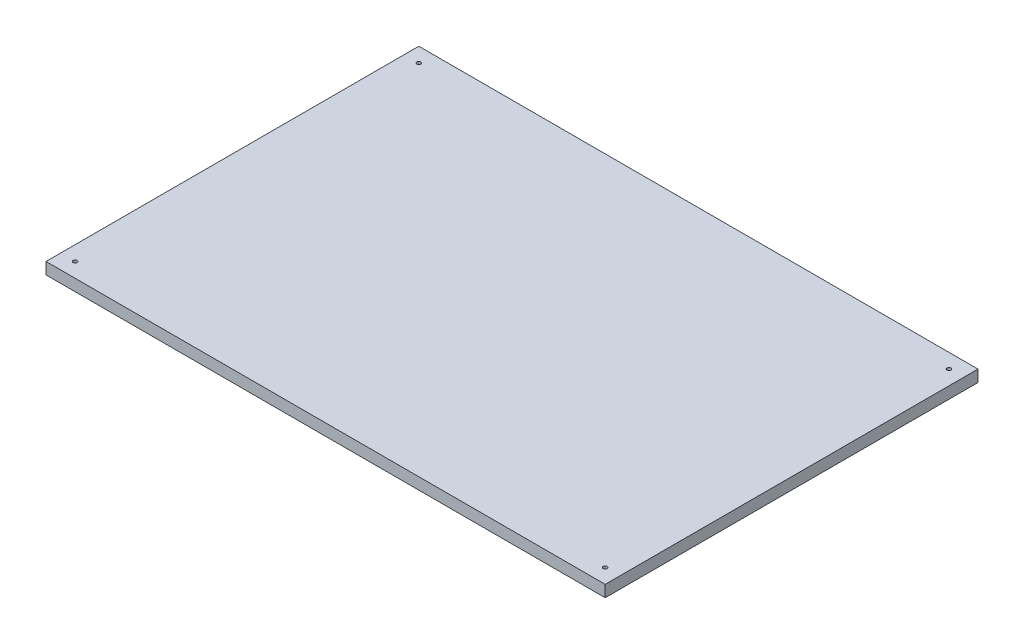
ISO-10303-21;
HEADER;
FILE_DESCRIPTION(('STEP AP214'),'2;1');
FILE_NAME('part.step','',(''),(''),'','','');
FILE_SCHEMA(('AUTOMOTIVE_DESIGN { 1 0 10303 214 1 1 1 1 }'));
ENDSEC;
DATA;
#1=APPLICATION_CONTEXT('core data for automotive mechanical design processes');
#2=APPLICATION_PROTOCOL_DEFINITION('international standard','automotive_design',2000,#1);
#3=PRODUCT_CONTEXT('',#1,'mechanical');
#4=PRODUCT('Part','Part','',(#3));
#5=PRODUCT_RELATED_PRODUCT_CATEGORY('part','',(#4));
#6=PRODUCT_DEFINITION_FORMATION('','',#4);
#7=PRODUCT_DEFINITION_CONTEXT('part definition',#1,'design');
#8=PRODUCT_DEFINITION('design','',#6,#7);
#9=PRODUCT_DEFINITION_SHAPE('','',#8);
#10=(LENGTH_UNIT() NAMED_UNIT(*) SI_UNIT(.MILLI.,.METRE.));
#11=(NAMED_UNIT(*) PLANE_ANGLE_UNIT() SI_UNIT($,.RADIAN.));
#12=(NAMED_UNIT(*) SI_UNIT($,.STERADIAN.) SOLID_ANGLE_UNIT());
#13=UNCERTAINTY_MEASURE_WITH_UNIT(LENGTH_MEASURE(1.E-05),#10,'distance_accuracy_value','');
#14=(GEOMETRIC_REPRESENTATION_CONTEXT(3) GLOBAL_UNCERTAINTY_ASSIGNED_CONTEXT((#13)) GLOBAL_UNIT_ASSIGNED_CONTEXT((#10,
#11,#12)) REPRESENTATION_CONTEXT('',''));
#15=CARTESIAN_POINT('',(0.,0.,0.));
#16=DIRECTION('',(0.,0.,1.));
#17=DIRECTION('',(1.,0.,0.));
#18=AXIS2_PLACEMENT_3D('',#15,#16,#17);
#19=CARTESIAN_POINT('',(-239.515434072486,10.,-77.7938023357789));
#20=DIRECTION('',(1.,0.,0.));
#21=DIRECTION('',(0.,0.,-1.));
#22=AXIS2_PLACEMENT_3D('',#19,#20,#21);
#23=PLANE('',#22);
#24=DIRECTION('',(0.,0.,1.));
#25=VECTOR('',#24,1.);
#26=CARTESIAN_POINT('',(-239.515434072486,0.,-77.7938023357789));
#27=LINE('',#26,#25);
#28=CARTESIAN_POINT('',(-239.515434072486,0.,-77.7938023357789));
#29=VERTEX_POINT('',#28);
#30=CARTESIAN_POINT('',(-239.515434072486,0.,242.206197664221));
#31=VERTEX_POINT('',#30);
#32=EDGE_CURVE('E95',#29,#31,#27,.T.);
#33=ORIENTED_EDGE('',*,*,#32,.T.);
#34=DIRECTION('',(0.,-1.,0.));
#35=VECTOR('',#34,1.);
#36=CARTESIAN_POINT('',(-239.515434072486,10.,242.206197664221));
#37=LINE('',#36,#35);
#38=CARTESIAN_POINT('',(-239.515434072486,10.,242.206197664221));
#39=VERTEX_POINT('',#38);
#40=EDGE_CURVE('E11',#39,#31,#37,.T.);
#41=ORIENTED_EDGE('',*,*,#40,.F.);
#42=DIRECTION('',(0.,0.,1.));
#43=VECTOR('',#42,1.);
#44=CARTESIAN_POINT('',(-239.515434072486,10.,-77.7938023357789));
#45=LINE('',#44,#43);
#46=CARTESIAN_POINT('',(-239.515434072486,10.,-77.7938023357789));
#47=VERTEX_POINT('',#46);
#48=EDGE_CURVE('E83',#47,#39,#45,.T.);
#49=ORIENTED_EDGE('',*,*,#48,.F.);
#50=DIRECTION('',(0.,-1.,0.));
#51=VECTOR('',#50,1.);
#52=CARTESIAN_POINT('',(-239.515434072486,10.,-77.7938023357789));
#53=LINE('',#52,#51);
#54=EDGE_CURVE('E91',#47,#29,#53,.T.);
#55=ORIENTED_EDGE('',*,*,#54,.T.);
#56=EDGE_LOOP('',(#33,#41,#49,#55));
#57=FACE_BOUND('',#56,.T.);
#58=ADVANCED_FACE('F32',(#57),#23,.F.);
#59=CARTESIAN_POINT('',(-239.515434072486,10.,242.206197664221));
#60=DIRECTION('',(0.,0.,-1.));
#61=DIRECTION('',(-1.,0.,0.));
#62=AXIS2_PLACEMENT_3D('',#59,#60,#61);
#63=PLANE('',#62);
#64=DIRECTION('',(1.,0.,0.));
#65=VECTOR('',#64,1.);
#66=CARTESIAN_POINT('',(-239.515434072486,0.,242.206197664221));
#67=LINE('',#66,#65);
#68=CARTESIAN_POINT('',(240.484565927514,0.,242.206197664221));
#69=VERTEX_POINT('',#68);
#70=EDGE_CURVE('E87',#31,#69,#67,.T.);
#71=ORIENTED_EDGE('',*,*,#70,.T.);
#72=DIRECTION('',(0.,-1.,0.));
#73=VECTOR('',#72,1.);
#74=CARTESIAN_POINT('',(240.484565927514,10.,242.206197664221));
#75=LINE('',#74,#73);
#76=CARTESIAN_POINT('',(240.484565927514,10.,242.206197664221));
#77=VERTEX_POINT('',#76);
#78=EDGE_CURVE('E40',#77,#69,#75,.T.);
#79=ORIENTED_EDGE('',*,*,#78,.F.);
#80=DIRECTION('',(1.,0.,0.));
#81=VECTOR('',#80,1.);
#82=CARTESIAN_POINT('',(-239.515434072486,10.,242.206197664221));
#83=LINE('',#82,#81);
#84=EDGE_CURVE('E78',#39,#77,#83,.T.);
#85=ORIENTED_EDGE('',*,*,#84,.F.);
#86=ORIENTED_EDGE('',*,*,#40,.T.);
#87=EDGE_LOOP('',(#71,#79,#85,#86));
#88=FACE_BOUND('',#87,.T.);
#89=ADVANCED_FACE('F86',(#88),#63,.F.);
#90=CARTESIAN_POINT('',(240.484565927514,10.,-77.7938023357789));
#91=DIRECTION('',(-1.,0.,0.));
#92=DIRECTION('',(0.,0.,1.));
#93=AXIS2_PLACEMENT_3D('',#90,#91,#92);
#94=PLANE('',#93);
#95=DIRECTION('',(0.,0.,-1.));
#96=VECTOR('',#95,1.);
#97=CARTESIAN_POINT('',(240.484565927514,0.,-77.7938023357789));
#98=LINE('',#97,#96);
#99=CARTESIAN_POINT('',(240.484565927514,0.,-77.7938023357789));
#100=VERTEX_POINT('',#99);
#101=EDGE_CURVE('E65',#69,#100,#98,.T.);
#102=ORIENTED_EDGE('',*,*,#101,.T.);
#103=DIRECTION('',(0.,-1.,0.));
#104=VECTOR('',#103,1.);
#105=CARTESIAN_POINT('',(240.484565927514,10.,-77.7938023357789));
#106=LINE('',#105,#104);
#107=CARTESIAN_POINT('',(240.484565927514,10.,-77.7938023357789));
#108=VERTEX_POINT('',#107);
#109=EDGE_CURVE('E88',#108,#100,#106,.T.);
#110=ORIENTED_EDGE('',*,*,#109,.F.);
#111=DIRECTION('',(0.,0.,-1.));
#112=VECTOR('',#111,1.);
#113=CARTESIAN_POINT('',(240.484565927514,10.,-77.7938023357789));
#114=LINE('',#113,#112);
#115=EDGE_CURVE('E81',#77,#108,#114,.T.);
#116=ORIENTED_EDGE('',*,*,#115,.F.);
#117=ORIENTED_EDGE('',*,*,#78,.T.);
#118=EDGE_LOOP('',(#102,#110,#116,#117));
#119=FACE_BOUND('',#118,.T.);
#120=ADVANCED_FACE('F89',(#119),#94,.F.);
#121=CARTESIAN_POINT('',(-239.515434072486,10.,-77.7938023357789));
#122=DIRECTION('',(0.,0.,1.));
#123=DIRECTION('',(1.,0.,0.));
#124=AXIS2_PLACEMENT_3D('',#121,#122,#123);
#125=PLANE('',#124);
#126=DIRECTION('',(-1.,0.,0.));
#127=VECTOR('',#126,1.);
#128=CARTESIAN_POINT('',(-239.515434072486,0.,-77.7938023357789));
#129=LINE('',#128,#127);
#130=EDGE_CURVE('E71',#100,#29,#129,.T.);
#131=ORIENTED_EDGE('',*,*,#130,.T.);
#132=ORIENTED_EDGE('',*,*,#54,.F.);
#133=DIRECTION('',(-1.,0.,0.));
#134=VECTOR('',#133,1.);
#135=CARTESIAN_POINT('',(-239.515434072486,10.,-77.7938023357789));
#136=LINE('',#135,#134);
#137=EDGE_CURVE('E48',#108,#47,#136,.T.);
#138=ORIENTED_EDGE('',*,*,#137,.F.);
#139=ORIENTED_EDGE('',*,*,#109,.T.);
#140=EDGE_LOOP('',(#131,#132,#138,#139));
#141=FACE_BOUND('',#140,.T.);
#142=ADVANCED_FACE('F103',(#141),#125,.F.);
#143=CARTESIAN_POINT('',(-239.515434072486,10.,242.206197664221));
#144=DIRECTION('',(0.,1.,0.));
#145=DIRECTION('',(0.,0.,1.));
#146=AXIS2_PLACEMENT_3D('',#143,#144,#145);
#147=PLANE('',#146);
#148=CARTESIAN_POINT('',(-227.015434072486,10.,229.706197664221));
#149=DIRECTION('',(0.,1.,0.));
#150=DIRECTION('',(0.,0.,1.));
#151=AXIS2_PLACEMENT_3D('',#148,#149,#150);
#152=CIRCLE('',#151,1.70000000000001);
#153=CARTESIAN_POINT('',(-227.015434072486,10.,231.406197664221));
#154=VERTEX_POINT('',#153);
#155=EDGE_CURVE('E127',#154,#154,#152,.T.);
#156=ORIENTED_EDGE('',*,*,#155,.F.);
#157=EDGE_LOOP('',(#156));
#158=FACE_BOUND('',#157,.T.);
#159=CARTESIAN_POINT('',(227.984565927514,10.,-65.2938023357789));
#160=DIRECTION('',(0.,1.,0.));
#161=DIRECTION('',(0.,0.,1.));
#162=AXIS2_PLACEMENT_3D('',#159,#160,#161);
#163=CIRCLE('',#162,1.70000000000001);
#164=CARTESIAN_POINT('',(227.984565927514,10.,-63.5938023357789));
#165=VERTEX_POINT('',#164);
#166=EDGE_CURVE('E121',#165,#165,#163,.T.);
#167=ORIENTED_EDGE('',*,*,#166,.F.);
#168=EDGE_LOOP('',(#167));
#169=FACE_BOUND('',#168,.T.);
#170=CARTESIAN_POINT('',(227.984565927514,10.,229.706197664221));
#171=DIRECTION('',(0.,1.,0.));
#172=DIRECTION('',(0.,0.,1.));
#173=AXIS2_PLACEMENT_3D('',#170,#171,#172);
#174=CIRCLE('',#173,1.70000000000001);
#175=CARTESIAN_POINT('',(227.984565927514,10.,231.406197664221));
#176=VERTEX_POINT('',#175);
#177=EDGE_CURVE('E115',#176,#176,#174,.T.);
#178=ORIENTED_EDGE('',*,*,#177,.F.);
#179=EDGE_LOOP('',(#178));
#180=FACE_BOUND('',#179,.T.);
#181=CARTESIAN_POINT('',(-227.015434072486,10.,-65.2938023357789));
#182=DIRECTION('',(0.,1.,0.));
#183=DIRECTION('',(0.,0.,1.));
#184=AXIS2_PLACEMENT_3D('',#181,#182,#183);
#185=CIRCLE('',#184,1.70000000000001);
#186=CARTESIAN_POINT('',(-227.015434072486,10.,-63.5938023357789));
#187=VERTEX_POINT('',#186);
#188=EDGE_CURVE('E109',#187,#187,#185,.T.);
#189=ORIENTED_EDGE('',*,*,#188,.F.);
#190=EDGE_LOOP('',(#189));
#191=FACE_BOUND('',#190,.T.);
#192=ORIENTED_EDGE('',*,*,#48,.T.);
#193=ORIENTED_EDGE('',*,*,#84,.T.);
#194=ORIENTED_EDGE('',*,*,#115,.T.);
#195=ORIENTED_EDGE('',*,*,#137,.T.);
#196=EDGE_LOOP('',(#192,#193,#194,#195));
#197=FACE_BOUND('',#196,.T.);
#198=ADVANCED_FACE('F79',(#158,#169,#180,#191,#197),#147,.T.);
#199=CARTESIAN_POINT('',(-239.515434072486,0.,242.206197664221));
#200=DIRECTION('',(0.,1.,0.));
#201=DIRECTION('',(0.,0.,1.));
#202=AXIS2_PLACEMENT_3D('',#199,#200,#201);
#203=PLANE('',#202);
#204=CARTESIAN_POINT('',(-227.015434072486,0.,229.706197664221));
#205=DIRECTION('',(0.,1.,0.));
#206=DIRECTION('',(0.,0.,1.));
#207=AXIS2_PLACEMENT_3D('',#204,#205,#206);
#208=CIRCLE('',#207,1.70000000000001);
#209=CARTESIAN_POINT('',(-227.015434072486,0.,231.406197664221));
#210=VERTEX_POINT('',#209);
#211=EDGE_CURVE('E124',#210,#210,#208,.T.);
#212=ORIENTED_EDGE('',*,*,#211,.T.);
#213=EDGE_LOOP('',(#212));
#214=FACE_BOUND('',#213,.T.);
#215=CARTESIAN_POINT('',(227.984565927514,0.,-65.2938023357789));
#216=DIRECTION('',(0.,1.,0.));
#217=DIRECTION('',(0.,0.,1.));
#218=AXIS2_PLACEMENT_3D('',#215,#216,#217);
#219=CIRCLE('',#218,1.70000000000001);
#220=CARTESIAN_POINT('',(227.984565927514,0.,-63.5938023357789));
#221=VERTEX_POINT('',#220);
#222=EDGE_CURVE('E118',#221,#221,#219,.T.);
#223=ORIENTED_EDGE('',*,*,#222,.T.);
#224=EDGE_LOOP('',(#223));
#225=FACE_BOUND('',#224,.T.);
#226=CARTESIAN_POINT('',(227.984565927514,0.,229.706197664221));
#227=DIRECTION('',(0.,1.,0.));
#228=DIRECTION('',(0.,0.,1.));
#229=AXIS2_PLACEMENT_3D('',#226,#227,#228);
#230=CIRCLE('',#229,1.70000000000001);
#231=CARTESIAN_POINT('',(227.984565927514,0.,231.406197664221));
#232=VERTEX_POINT('',#231);
#233=EDGE_CURVE('E112',#232,#232,#230,.T.);
#234=ORIENTED_EDGE('',*,*,#233,.T.);
#235=EDGE_LOOP('',(#234));
#236=FACE_BOUND('',#235,.T.);
#237=CARTESIAN_POINT('',(-227.015434072486,0.,-65.2938023357789));
#238=DIRECTION('',(0.,1.,0.));
#239=DIRECTION('',(0.,0.,1.));
#240=AXIS2_PLACEMENT_3D('',#237,#238,#239);
#241=CIRCLE('',#240,1.70000000000001);
#242=CARTESIAN_POINT('',(-227.015434072486,0.,-63.5938023357789));
#243=VERTEX_POINT('',#242);
#244=EDGE_CURVE('E98',#243,#243,#241,.T.);
#245=ORIENTED_EDGE('',*,*,#244,.T.);
#246=EDGE_LOOP('',(#245));
#247=FACE_BOUND('',#246,.T.);
#248=ORIENTED_EDGE('',*,*,#32,.F.);
#249=ORIENTED_EDGE('',*,*,#130,.F.);
#250=ORIENTED_EDGE('',*,*,#101,.F.);
#251=ORIENTED_EDGE('',*,*,#70,.F.);
#252=EDGE_LOOP('',(#248,#249,#250,#251));
#253=FACE_BOUND('',#252,.T.);
#254=ADVANCED_FACE('F106',(#214,#225,#236,#247,#253),#203,.F.);
#255=CARTESIAN_POINT('',(-227.015434072486,0.,-65.2938023357789));
#256=DIRECTION('',(0.,1.,0.));
#257=DIRECTION('',(0.,0.,1.));
#258=AXIS2_PLACEMENT_3D('',#255,#256,#257);
#259=CYLINDRICAL_SURFACE('',#258,1.70000000000001);
#260=ORIENTED_EDGE('',*,*,#244,.F.);
#261=EDGE_LOOP('',(#260));
#262=FACE_BOUND('',#261,.T.);
#263=ORIENTED_EDGE('',*,*,#188,.T.);
#264=EDGE_LOOP('',(#263));
#265=FACE_BOUND('',#264,.T.);
#266=ADVANCED_FACE('F151',(#262,#265),#259,.F.);
#267=CARTESIAN_POINT('',(227.984565927514,0.,229.706197664221));
#268=DIRECTION('',(0.,1.,0.));
#269=DIRECTION('',(0.,0.,1.));
#270=AXIS2_PLACEMENT_3D('',#267,#268,#269);
#271=CYLINDRICAL_SURFACE('',#270,1.70000000000001);
#272=ORIENTED_EDGE('',*,*,#233,.F.);
#273=EDGE_LOOP('',(#272));
#274=FACE_BOUND('',#273,.T.);
#275=ORIENTED_EDGE('',*,*,#177,.T.);
#276=EDGE_LOOP('',(#275));
#277=FACE_BOUND('',#276,.T.);
#278=ADVANCED_FACE('F153',(#274,#277),#271,.F.);
#279=CARTESIAN_POINT('',(227.984565927514,0.,-65.2938023357789));
#280=DIRECTION('',(0.,1.,0.));
#281=DIRECTION('',(0.,0.,1.));
#282=AXIS2_PLACEMENT_3D('',#279,#280,#281);
#283=CYLINDRICAL_SURFACE('',#282,1.70000000000001);
#284=ORIENTED_EDGE('',*,*,#222,.F.);
#285=EDGE_LOOP('',(#284));
#286=FACE_BOUND('',#285,.T.);
#287=ORIENTED_EDGE('',*,*,#166,.T.);
#288=EDGE_LOOP('',(#287));
#289=FACE_BOUND('',#288,.T.);
#290=ADVANCED_FACE('F138',(#286,#289),#283,.F.);
#291=CARTESIAN_POINT('',(-227.015434072486,0.,229.706197664221));
#292=DIRECTION('',(0.,1.,0.));
#293=DIRECTION('',(0.,0.,1.));
#294=AXIS2_PLACEMENT_3D('',#291,#292,#293);
#295=CYLINDRICAL_SURFACE('',#294,1.70000000000001);
#296=ORIENTED_EDGE('',*,*,#211,.F.);
#297=EDGE_LOOP('',(#296));
#298=FACE_BOUND('',#297,.T.);
#299=ORIENTED_EDGE('',*,*,#155,.T.);
#300=EDGE_LOOP('',(#299));
#301=FACE_BOUND('',#300,.T.);
#302=ADVANCED_FACE('F135',(#298,#301),#295,.F.);
#303=CLOSED_SHELL('',(#58,#89,#120,#142,#198,#254,#266,#278,#290,#302));
#304=MANIFOLD_SOLID_BREP('B2',#303);
#305=ADVANCED_BREP_SHAPE_REPRESENTATION('',(#18,#304),#14);
#306=SHAPE_DEFINITION_REPRESENTATION(#9,#305);
ENDSEC;
END-ISO-10303-21;
